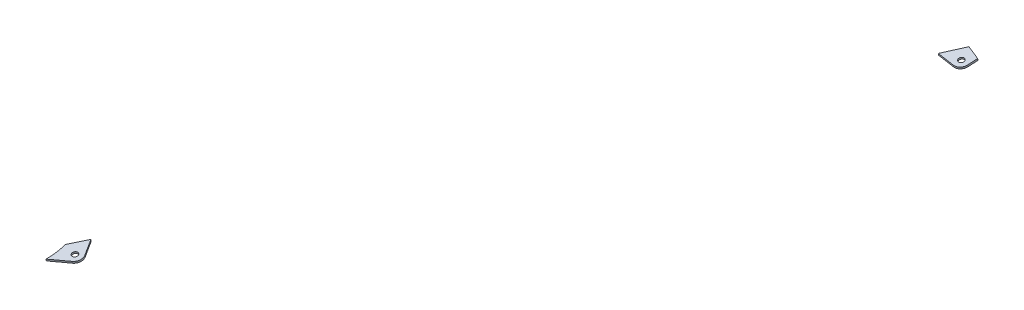
ISO-10303-21;
HEADER;
FILE_DESCRIPTION(('STEP AP214'),'2;1');
FILE_NAME('part.step','',(''),(''),'','','');
FILE_SCHEMA(('AUTOMOTIVE_DESIGN { 1 0 10303 214 1 1 1 1 }'));
ENDSEC;
DATA;
#1=APPLICATION_CONTEXT('core data for automotive mechanical design processes');
#2=APPLICATION_PROTOCOL_DEFINITION('international standard','automotive_design',2000,#1);
#3=PRODUCT_CONTEXT('',#1,'mechanical');
#4=PRODUCT('Part','Part','',(#3));
#5=PRODUCT_RELATED_PRODUCT_CATEGORY('part','',(#4));
#6=PRODUCT_DEFINITION_FORMATION('','',#4);
#7=PRODUCT_DEFINITION_CONTEXT('part definition',#1,'design');
#8=PRODUCT_DEFINITION('design','',#6,#7);
#9=PRODUCT_DEFINITION_SHAPE('','',#8);
#10=(LENGTH_UNIT() NAMED_UNIT(*) SI_UNIT(.MILLI.,.METRE.));
#11=(NAMED_UNIT(*) PLANE_ANGLE_UNIT() SI_UNIT($,.RADIAN.));
#12=(NAMED_UNIT(*) SI_UNIT($,.STERADIAN.) SOLID_ANGLE_UNIT());
#13=UNCERTAINTY_MEASURE_WITH_UNIT(LENGTH_MEASURE(1.E-05),#10,'distance_accuracy_value','');
#14=(GEOMETRIC_REPRESENTATION_CONTEXT(3) GLOBAL_UNCERTAINTY_ASSIGNED_CONTEXT((#13)) GLOBAL_UNIT_ASSIGNED_CONTEXT((#10,
#11,#12)) REPRESENTATION_CONTEXT('',''));
#15=CARTESIAN_POINT('',(0.,0.,0.));
#16=DIRECTION('',(0.,0.,1.));
#17=DIRECTION('',(1.,0.,0.));
#18=AXIS2_PLACEMENT_3D('',#15,#16,#17);
#19=CARTESIAN_POINT('',(1354.98932451011,276.212451039503,480.361696182311));
#20=DIRECTION('',(0.,-0.981627183447661,-0.190808995376562));
#21=DIRECTION('',(0.,0.190808995376562,-0.981627183447661));
#22=AXIS2_PLACEMENT_3D('',#19,#20,#21);
#23=PLANE('',#22);
#24=CARTESIAN_POINT('',(1354.98932451011,276.212451039503,480.361696182311));
#25=DIRECTION('',(0.,-0.981627183447661,-0.190808995376562));
#26=DIRECTION('',(0.,0.190808995376562,-0.981627183447661));
#27=AXIS2_PLACEMENT_3D('',#24,#25,#26);
#28=CIRCLE('',#27,7.99999999999986);
#29=CARTESIAN_POINT('',(1362.92379772878,276.017476852443,481.364751419359));
#30=VERTEX_POINT('',#29);
#31=CARTESIAN_POINT('',(1353.96749539416,274.698482175806,488.150390780096));
#32=VERTEX_POINT('',#31);
#33=EDGE_CURVE('E167',#30,#32,#28,.T.);
#34=ORIENTED_EDGE('',*,*,#33,.T.);
#35=DIRECTION('',(-0.991809152333897,0.0243717733825106,-0.125381904631039));
#36=VECTOR('',#35,1.);
#37=CARTESIAN_POINT('',(1353.96749539416,274.698482175806,488.150390780096));
#38=LINE('',#37,#36);
#39=CARTESIAN_POINT('',(1335.13531275181,275.161246293861,485.769675778116));
#40=VERTEX_POINT('',#39);
#41=EDGE_CURVE('E95',#32,#40,#38,.T.);
#42=ORIENTED_EDGE('',*,*,#41,.T.);
#43=CARTESIAN_POINT('',(1335.13531275181,275.161246293861,485.769675778116));
#44=CARTESIAN_POINT('',(1339.85772152624,276.415392376429,479.317653512426));
#45=CARTESIAN_POINT('',(1344.58198837943,277.670037192716,472.863065484177));
#46=CARTESIAN_POINT('',(1349.30810444123,278.92517838675,466.4059238138));
#47=(BOUNDED_CURVE() B_SPLINE_CURVE(3,(#43,#44,#45,#46),.UNSPECIFIED.,.F.,
.F.) B_SPLINE_CURVE_WITH_KNOTS((4,4),(0.966451554038019,1.),
.UNSPECIFIED.) CURVE() GEOMETRIC_REPRESENTATION_ITEM() RATIONAL_B_SPLINE_CURVE((0.999946517430463,
0.999963726106587,0.999981553629766,1.)) REPRESENTATION_ITEM(''));
#48=CARTESIAN_POINT('',(1349.30810444123,278.92517838675,466.4059238138));
#49=VERTEX_POINT('',#48);
#50=EDGE_CURVE('E99',#40,#49,#47,.T.);
#51=ORIENTED_EDGE('',*,*,#50,.T.);
#52=CARTESIAN_POINT('',(1349.30810444123,278.92517838675,466.4059238138));
#53=CARTESIAN_POINT('',(1354.32710970895,278.559702671224,468.286133373849));
#54=CARTESIAN_POINT('',(1359.30519225234,278.211483863424,470.077563839949));
#55=CARTESIAN_POINT('',(1364.18260300115,277.882555815343,471.769751950667));
#56=(BOUNDED_CURVE() B_SPLINE_CURVE(3,(#52,#53,#54,#55),.UNSPECIFIED.,.F.,
.F.) B_SPLINE_CURVE_WITH_KNOTS((4,4),(0.918491708652487,1.),
.UNSPECIFIED.) CURVE() GEOMETRIC_REPRESENTATION_ITEM() RATIONAL_B_SPLINE_CURVE((0.85094018893203,
0.896217531077208,0.945904134766531,1.)) REPRESENTATION_ITEM(''));
#57=CARTESIAN_POINT('',(1364.18260300115,277.882555815343,471.769751950667));
#58=VERTEX_POINT('',#57);
#59=EDGE_CURVE('E103',#49,#58,#56,.T.);
#60=ORIENTED_EDGE('',*,*,#59,.T.);
#61=DIRECTION('',(-0.127728639492945,-0.189246107962107,0.973586824723135));
#62=VECTOR('',#61,1.);
#63=CARTESIAN_POINT('',(1362.92379772878,276.017476852443,481.364751419359));
#64=LINE('',#63,#62);
#65=EDGE_CURVE('E61',#58,#30,#64,.T.);
#66=ORIENTED_EDGE('',*,*,#65,.T.);
#67=EDGE_LOOP('',(#34,#42,#51,#60,#66));
#68=FACE_BOUND('',#67,.T.);
#69=CARTESIAN_POINT('',(1354.98932451011,276.212451039503,480.361696182311));
#70=DIRECTION('',(0.,-0.981627183447661,-0.190808995376562));
#71=DIRECTION('',(0.,0.190808995376562,-0.981627183447661));
#72=AXIS2_PLACEMENT_3D('',#69,#70,#71);
#73=CIRCLE('',#72,2.99999999999991);
#74=CARTESIAN_POINT('',(1354.98932451011,276.784878025633,477.416814631968));
#75=VERTEX_POINT('',#74);
#76=EDGE_CURVE('E158',#75,#75,#73,.T.);
#77=ORIENTED_EDGE('',*,*,#76,.F.);
#78=EDGE_LOOP('',(#77));
#79=FACE_BOUND('',#78,.T.);
#80=ADVANCED_FACE('F44',(#68,#79),#23,.T.);
#81=CARTESIAN_POINT('',(1354.98932451011,278.175705406398,480.743314173064));
#82=DIRECTION('',(0.,-0.981627183447661,-0.190808995376562));
#83=DIRECTION('',(0.,0.190808995376562,-0.981627183447661));
#84=AXIS2_PLACEMENT_3D('',#81,#82,#83);
#85=PLANE('',#84);
#86=CARTESIAN_POINT('',(1354.98932451011,278.175705406398,480.743314173064));
#87=DIRECTION('',(0.,-0.981627183447661,-0.190808995376562));
#88=DIRECTION('',(0.,0.190808995376562,-0.981627183447661));
#89=AXIS2_PLACEMENT_3D('',#86,#87,#88);
#90=CIRCLE('',#89,7.99999999999986);
#91=CARTESIAN_POINT('',(1362.92379772878,277.980731219338,481.746369410112));
#92=VERTEX_POINT('',#91);
#93=CARTESIAN_POINT('',(1353.96749539416,276.661736542701,488.532008770849));
#94=VERTEX_POINT('',#93);
#95=EDGE_CURVE('E164',#92,#94,#90,.T.);
#96=ORIENTED_EDGE('',*,*,#95,.F.);
#97=DIRECTION('',(-0.127728639492945,-0.189246107962107,0.973586824723135));
#98=VECTOR('',#97,1.);
#99=CARTESIAN_POINT('',(1362.92379772878,277.980731219338,481.746369410112));
#100=LINE('',#99,#98);
#101=CARTESIAN_POINT('',(1364.18260300115,279.845810182239,472.15136994142));
#102=VERTEX_POINT('',#101);
#103=EDGE_CURVE('E87',#102,#92,#100,.T.);
#104=ORIENTED_EDGE('',*,*,#103,.F.);
#105=CARTESIAN_POINT('',(1349.30810444123,280.888432753645,466.787541804553));
#106=CARTESIAN_POINT('',(1354.32710970895,280.522957038119,468.667751364602));
#107=CARTESIAN_POINT('',(1359.30519225234,280.17473823032,470.459181830702));
#108=CARTESIAN_POINT('',(1364.18260300115,279.845810182239,472.15136994142));
#109=(BOUNDED_CURVE() B_SPLINE_CURVE(3,(#105,#106,#107,#108),.UNSPECIFIED.,.F.,
.F.) B_SPLINE_CURVE_WITH_KNOTS((4,4),(0.918491708652487,1.),
.UNSPECIFIED.) CURVE() GEOMETRIC_REPRESENTATION_ITEM() RATIONAL_B_SPLINE_CURVE((0.85094018893203,
0.896217531077208,0.945904134766531,1.)) REPRESENTATION_ITEM(''));
#110=CARTESIAN_POINT('',(1349.30810444123,280.888432753645,466.787541804553));
#111=VERTEX_POINT('',#110);
#112=EDGE_CURVE('E81',#111,#102,#109,.T.);
#113=ORIENTED_EDGE('',*,*,#112,.F.);
#114=CARTESIAN_POINT('',(1335.13531275181,277.124500660756,486.151293768869));
#115=CARTESIAN_POINT('',(1339.85772152624,278.378646743324,479.699271503179));
#116=CARTESIAN_POINT('',(1344.58198837943,279.633291559612,473.24468347493));
#117=CARTESIAN_POINT('',(1349.30810444123,280.888432753645,466.787541804553));
#118=(BOUNDED_CURVE() B_SPLINE_CURVE(3,(#114,#115,#116,#117),.UNSPECIFIED.,.F.,
.F.) B_SPLINE_CURVE_WITH_KNOTS((4,4),(0.966451554038019,1.),
.UNSPECIFIED.) CURVE() GEOMETRIC_REPRESENTATION_ITEM() RATIONAL_B_SPLINE_CURVE((0.999946517430463,
0.999963726106587,0.999981553629766,1.)) REPRESENTATION_ITEM(''));
#119=CARTESIAN_POINT('',(1335.13531275181,277.124500660756,486.151293768869));
#120=VERTEX_POINT('',#119);
#121=EDGE_CURVE('E110',#120,#111,#118,.T.);
#122=ORIENTED_EDGE('',*,*,#121,.F.);
#123=DIRECTION('',(-0.991809152333897,0.0243717733825106,-0.125381904631039));
#124=VECTOR('',#123,1.);
#125=CARTESIAN_POINT('',(1353.96749539416,276.661736542701,488.532008770849));
#126=LINE('',#125,#124);
#127=EDGE_CURVE('E178',#94,#120,#126,.T.);
#128=ORIENTED_EDGE('',*,*,#127,.F.);
#129=EDGE_LOOP('',(#96,#104,#113,#122,#128));
#130=FACE_BOUND('',#129,.T.);
#131=CARTESIAN_POINT('',(1354.98932451011,278.175705406398,480.743314173064));
#132=DIRECTION('',(0.,-0.981627183447661,-0.190808995376562));
#133=DIRECTION('',(0.,0.190808995376562,-0.981627183447661));
#134=AXIS2_PLACEMENT_3D('',#131,#132,#133);
#135=CIRCLE('',#134,2.99999999999991);
#136=CARTESIAN_POINT('',(1354.98932451011,278.748132392528,477.798432622721));
#137=VERTEX_POINT('',#136);
#138=EDGE_CURVE('E161',#137,#137,#135,.T.);
#139=ORIENTED_EDGE('',*,*,#138,.T.);
#140=EDGE_LOOP('',(#139));
#141=FACE_BOUND('',#140,.T.);
#142=ADVANCED_FACE('F140',(#130,#141),#85,.F.);
#143=CARTESIAN_POINT('',(1354.98932451011,276.212451039503,480.361696182311));
#144=DIRECTION('',(0.,0.981627183447661,0.190808995376562));
#145=DIRECTION('',(0.,-0.190808995376562,0.981627183447661));
#146=AXIS2_PLACEMENT_3D('',#143,#144,#145);
#147=CYLINDRICAL_SURFACE('',#146,7.99999999999986);
#148=ORIENTED_EDGE('',*,*,#95,.T.);
#149=DIRECTION('',(0.,0.981627183447661,0.190808995376562));
#150=VECTOR('',#149,1.);
#151=CARTESIAN_POINT('',(1353.96749539416,274.698482175806,488.150390780096));
#152=LINE('',#151,#150);
#153=EDGE_CURVE('E12',#32,#94,#152,.T.);
#154=ORIENTED_EDGE('',*,*,#153,.F.);
#155=ORIENTED_EDGE('',*,*,#33,.F.);
#156=DIRECTION('',(0.,0.981627183447661,0.190808995376562));
#157=VECTOR('',#156,1.);
#158=CARTESIAN_POINT('',(1362.92379772878,276.017476852443,481.364751419359));
#159=LINE('',#158,#157);
#160=EDGE_CURVE('E115',#30,#92,#159,.T.);
#161=ORIENTED_EDGE('',*,*,#160,.T.);
#162=EDGE_LOOP('',(#148,#154,#155,#161));
#163=FACE_BOUND('',#162,.T.);
#164=ADVANCED_FACE('F46',(#163),#147,.T.);
#165=CARTESIAN_POINT('',(1353.96749539416,274.698482175806,488.150390780096));
#166=DIRECTION('',(0.127728639492932,0.189246107962104,-0.973586824723137));
#167=DIRECTION('',(0.,0.981627183447662,0.190808995376555));
#168=AXIS2_PLACEMENT_3D('',#165,#166,#167);
#169=PLANE('',#168);
#170=ORIENTED_EDGE('',*,*,#127,.T.);
#171=DIRECTION('',(0.,0.981627183447661,0.190808995376562));
#172=VECTOR('',#171,1.);
#173=CARTESIAN_POINT('',(1335.13531275181,275.161246293861,485.769675778116));
#174=LINE('',#173,#172);
#175=EDGE_CURVE('E53',#40,#120,#174,.T.);
#176=ORIENTED_EDGE('',*,*,#175,.F.);
#177=ORIENTED_EDGE('',*,*,#41,.F.);
#178=ORIENTED_EDGE('',*,*,#153,.T.);
#179=EDGE_LOOP('',(#170,#176,#177,#178));
#180=FACE_BOUND('',#179,.T.);
#181=ADVANCED_FACE('F135',(#180),#169,.F.);
#182=DIRECTION('',(0.,0.981627183447661,0.190808995376562));
#183=VECTOR('',#182,1.);
#184=SURFACE_OF_LINEAR_EXTRUSION('',#47,#183);
#185=ORIENTED_EDGE('',*,*,#121,.T.);
#186=DIRECTION('',(0.,0.981627183447661,0.190808995376562));
#187=VECTOR('',#186,1.);
#188=CARTESIAN_POINT('',(1349.30810444123,278.92517838675,466.4059238138));
#189=LINE('',#188,#187);
#190=EDGE_CURVE('E107',#49,#111,#189,.T.);
#191=ORIENTED_EDGE('',*,*,#190,.F.);
#192=ORIENTED_EDGE('',*,*,#50,.F.);
#193=ORIENTED_EDGE('',*,*,#175,.T.);
#194=EDGE_LOOP('',(#185,#191,#192,#193));
#195=FACE_BOUND('',#194,.T.);
#196=ADVANCED_FACE('F108',(#195),#184,.F.);
#197=DIRECTION('',(0.,0.981627183447661,0.190808995376562));
#198=VECTOR('',#197,1.);
#199=SURFACE_OF_LINEAR_EXTRUSION('',#56,#198);
#200=ORIENTED_EDGE('',*,*,#112,.T.);
#201=DIRECTION('',(0.,0.981627183447661,0.190808995376562));
#202=VECTOR('',#201,1.);
#203=CARTESIAN_POINT('',(1364.18260300115,277.882555815343,471.769751950667));
#204=LINE('',#203,#202);
#205=EDGE_CURVE('E111',#58,#102,#204,.T.);
#206=ORIENTED_EDGE('',*,*,#205,.F.);
#207=ORIENTED_EDGE('',*,*,#59,.F.);
#208=ORIENTED_EDGE('',*,*,#190,.T.);
#209=EDGE_LOOP('',(#200,#206,#207,#208));
#210=FACE_BOUND('',#209,.T.);
#211=ADVANCED_FACE('F113',(#210),#199,.F.);
#212=CARTESIAN_POINT('',(1362.92379772878,276.017476852443,481.364751419359));
#213=DIRECTION('',(-0.991809152333896,0.024371773382512,-0.125381904631052));
#214=DIRECTION('',(-0.125419158609162,0.,0.992103842676647));
#215=AXIS2_PLACEMENT_3D('',#212,#213,#214);
#216=PLANE('',#215);
#217=ORIENTED_EDGE('',*,*,#103,.T.);
#218=ORIENTED_EDGE('',*,*,#160,.F.);
#219=ORIENTED_EDGE('',*,*,#65,.F.);
#220=ORIENTED_EDGE('',*,*,#205,.T.);
#221=EDGE_LOOP('',(#217,#218,#219,#220));
#222=FACE_BOUND('',#221,.T.);
#223=ADVANCED_FACE('F132',(#222),#216,.F.);
#224=CARTESIAN_POINT('',(1354.98932451011,276.212451039503,480.361696182311));
#225=DIRECTION('',(0.,0.981627183447661,0.190808995376562));
#226=DIRECTION('',(0.,-0.190808995376562,0.981627183447661));
#227=AXIS2_PLACEMENT_3D('',#224,#225,#226);
#228=CYLINDRICAL_SURFACE('',#227,2.99999999999991);
#229=ORIENTED_EDGE('',*,*,#76,.T.);
#230=EDGE_LOOP('',(#229));
#231=FACE_BOUND('',#230,.T.);
#232=ORIENTED_EDGE('',*,*,#138,.F.);
#233=EDGE_LOOP('',(#232));
#234=FACE_BOUND('',#233,.T.);
#235=ADVANCED_FACE('F149',(#231,#234),#228,.F.);
#236=CLOSED_SHELL('',(#80,#142,#164,#181,#196,#211,#223,#235));
#237=MANIFOLD_SOLID_BREP('B2',#236);
#238=CARTESIAN_POINT('',(932.480143644817,166.144613374247,1046.61163247233));
#239=DIRECTION('',(1.32856421615641E-11,-0.981627183448244,-0.190808995373559));
#240=DIRECTION('',(0.,0.190808995373559,-0.981627183448244));
#241=AXIS2_PLACEMENT_3D('',#238,#239,#240);
#242=PLANE('',#241);
#243=CARTESIAN_POINT('',(932.070864738082,168.131195258437,1036.39155466197));
#244=CARTESIAN_POINT('',(932.179682868194,167.903790071605,1037.56145292913));
#245=CARTESIAN_POINT('',(932.271293946924,167.676283122056,1038.7318747201));
#246=CARTESIAN_POINT('',(932.467876959003,167.040938195084,1042.00044101568));
#247=CARTESIAN_POINT('',(932.526546787791,166.632826386435,1044.09999425983));
#248=CARTESIAN_POINT('',(932.450892162383,165.815461398526,1048.30497259089));
#249=CARTESIAN_POINT('',(932.317793571358,165.406215469037,1050.41036038096));
#250=CARTESIAN_POINT('',(931.904919364846,164.791085551674,1053.57492946767));
#251=CARTESIAN_POINT('',(931.730758064932,164.585601225413,1054.63205468356));
#252=CARTESIAN_POINT('',(931.433937078824,164.307083304953,1056.06490516978));
#253=CARTESIAN_POINT('',(931.346908094581,164.23129641706,1056.45479490825));
#254=CARTESIAN_POINT('',(931.253435448425,164.155870494633,1056.84282764038));
#255=B_SPLINE_CURVE_WITH_KNOTS('',3,(#243,#244,#245,#246,#247,#248,#249,#250,#251,#252,#253,
#254),.UNSPECIFIED.,.F.,.F.,(4,2,2,2,2,4),(0.0389952168181723,0.108784614257796,
0.233784614257793,0.35878461425779,0.421284614257795,0.444789397439628),.UNSPECIFIED.);
#256=CARTESIAN_POINT('',(931.253435448425,164.155870494633,1056.84282764038));
#257=VERTEX_POINT('',#256);
#258=CARTESIAN_POINT('',(932.070864738085,168.131195258429,1036.39155466201));
#259=VERTEX_POINT('',#258);
#260=EDGE_CURVE('E324',#257,#259,#255,.F.);
#261=ORIENTED_EDGE('',*,*,#260,.T.);
#262=CARTESIAN_POINT('',(932.070864738085,168.131195258429,1036.39155466201));
#263=CARTESIAN_POINT('',(936.101696367413,169.143684342061,1031.18274988068));
#264=CARTESIAN_POINT('',(940.13433811071,170.156631841329,1025.97158675535));
#265=CARTESIAN_POINT('',(944.168784694913,171.17003643188,1020.75807209923));
#266=(BOUNDED_CURVE() B_SPLINE_CURVE(3,(#262,#263,#264,#265),.UNSPECIFIED.,.F.,
.F.) B_SPLINE_CURVE_WITH_KNOTS((4,4),(0.,0.0283733380516184),
.UNSPECIFIED.) CURVE() GEOMETRIC_REPRESENTATION_ITEM() RATIONAL_B_SPLINE_CURVE((1.,
0.9999843991254,0.999969240899689,0.999954525322867)) REPRESENTATION_ITEM(''));
#267=CARTESIAN_POINT('',(944.168784694913,171.17003643188,1020.75807209923));
#268=VERTEX_POINT('',#267);
#269=EDGE_CURVE('E293',#259,#268,#266,.T.);
#270=ORIENTED_EDGE('',*,*,#269,.T.);
#271=DIRECTION('',(0.48900119651544,-0.166439464539092,0.856256815710338));
#272=VECTOR('',#271,1.);
#273=CARTESIAN_POINT('',(952.848375326929,168.21579740853,1035.95631433094));
#274=LINE('',#273,#272);
#275=CARTESIAN_POINT('',(952.848375326929,168.21579740853,1035.95631433094));
#276=VERTEX_POINT('',#275);
#277=EDGE_CURVE('E297',#268,#276,#274,.T.);
#278=ORIENTED_EDGE('',*,*,#277,.T.);
#279=CARTESIAN_POINT('',(945.870110420262,167.46935079217,1039.79644926885));
#280=DIRECTION('',(0.,-0.981627183447661,-0.190808995376562));
#281=DIRECTION('',(0.,0.190808995376562,-0.981627183447661));
#282=AXIS2_PLACEMENT_3D('',#279,#280,#281);
#283=CIRCLE('',#282,7.9999999999998);
#284=CARTESIAN_POINT('',(949.782119992386,166.137835075857,1046.64650379453));
#285=VERTEX_POINT('',#284);
#286=EDGE_CURVE('E301',#276,#285,#283,.T.);
#287=ORIENTED_EDGE('',*,*,#286,.T.);
#288=DIRECTION('',(-0.872283113333745,-0.0933058270448596,0.48001686723725));
#289=VECTOR('',#288,1.);
#290=CARTESIAN_POINT('',(949.782119992386,166.137835075857,1046.64650379453));
#291=LINE('',#290,#289);
#292=EDGE_CURVE('E259',#285,#257,#291,.T.);
#293=ORIENTED_EDGE('',*,*,#292,.T.);
#294=EDGE_LOOP('',(#261,#270,#278,#287,#293));
#295=FACE_BOUND('',#294,.T.);
#296=CARTESIAN_POINT('',(945.870110420262,167.46935079217,1039.79644926885));
#297=DIRECTION('',(0.,-0.981627183447661,-0.190808995376562));
#298=DIRECTION('',(0.,0.190808995376562,-0.981627183447661));
#299=AXIS2_PLACEMENT_3D('',#296,#297,#298);
#300=CIRCLE('',#299,2.99999999999994);
#301=CARTESIAN_POINT('',(945.870110420262,168.041777778299,1036.8515677185));
#302=VERTEX_POINT('',#301);
#303=EDGE_CURVE('E364',#302,#302,#300,.T.);
#304=ORIENTED_EDGE('',*,*,#303,.F.);
#305=EDGE_LOOP('',(#304));
#306=FACE_BOUND('',#305,.T.);
#307=ADVANCED_FACE('F236',(#295,#306),#242,.T.);
#308=CARTESIAN_POINT('',(932.480143644817,168.107867741142,1046.99325046308));
#309=DIRECTION('',(1.32856421615641E-11,-0.981627183448244,-0.190808995373559));
#310=DIRECTION('',(0.,0.190808995373559,-0.981627183448244));
#311=AXIS2_PLACEMENT_3D('',#308,#309,#310);
#312=PLANE('',#311);
#313=CARTESIAN_POINT('',(931.253435448425,166.119124861528,1057.22444563113));
#314=CARTESIAN_POINT('',(931.346908094581,166.194550783955,1056.836412899));
#315=CARTESIAN_POINT('',(931.433937078824,166.270337671848,1056.44652316053));
#316=CARTESIAN_POINT('',(931.730758064932,166.548855592308,1055.01367267431));
#317=CARTESIAN_POINT('',(931.904919364846,166.75433991857,1053.95654745843));
#318=CARTESIAN_POINT('',(932.317793571358,167.369469835933,1050.79197837171));
#319=CARTESIAN_POINT('',(932.450892162383,167.778715765422,1048.68659058164));
#320=CARTESIAN_POINT('',(932.526546787791,168.59608075333,1044.48161225058));
#321=CARTESIAN_POINT('',(932.467876959003,169.004192561979,1042.38205900643));
#322=CARTESIAN_POINT('',(932.271293946924,169.639537488951,1039.11349271085));
#323=CARTESIAN_POINT('',(932.179682868194,169.867044438501,1037.94307091989));
#324=CARTESIAN_POINT('',(932.070864738082,170.094449625332,1036.77317265272));
#325=B_SPLINE_CURVE_WITH_KNOTS('',3,(#313,#314,#315,#316,#317,#318,#319,#320,#321,#322,#323,
#324),.UNSPECIFIED.,.F.,.F.,(4,2,2,2,2,4),(0.0389952168181723,0.0625000000000052,
0.12500000000001,0.250000000000007,0.375000000000004,0.444789397439628),.UNSPECIFIED.);
#326=CARTESIAN_POINT('',(931.253435448425,166.119124861528,1057.22444563113));
#327=VERTEX_POINT('',#326);
#328=CARTESIAN_POINT('',(932.070864738086,170.094449625324,1036.77317265276));
#329=VERTEX_POINT('',#328);
#330=EDGE_CURVE('E362',#327,#329,#325,.T.);
#331=ORIENTED_EDGE('',*,*,#330,.F.);
#332=DIRECTION('',(-0.872283113333745,-0.0933058270448596,0.48001686723725));
#333=VECTOR('',#332,1.);
#334=CARTESIAN_POINT('',(949.782119992386,168.101089442752,1047.02812178528));
#335=LINE('',#334,#333);
#336=CARTESIAN_POINT('',(949.782119992386,168.101089442752,1047.02812178528));
#337=VERTEX_POINT('',#336);
#338=EDGE_CURVE('E285',#337,#327,#335,.T.);
#339=ORIENTED_EDGE('',*,*,#338,.F.);
#340=CARTESIAN_POINT('',(945.870110420263,169.432605159065,1040.1780672596));
#341=DIRECTION('',(0.,-0.981627183447661,-0.190808995376562));
#342=DIRECTION('',(0.,0.190808995376562,-0.981627183447661));
#343=AXIS2_PLACEMENT_3D('',#340,#341,#342);
#344=CIRCLE('',#343,7.9999999999998);
#345=CARTESIAN_POINT('',(952.848375326929,170.179051775425,1036.3379323217));
#346=VERTEX_POINT('',#345);
#347=EDGE_CURVE('E279',#346,#337,#344,.T.);
#348=ORIENTED_EDGE('',*,*,#347,.F.);
#349=DIRECTION('',(0.48900119651544,-0.166439464539092,0.856256815710338));
#350=VECTOR('',#349,1.);
#351=CARTESIAN_POINT('',(952.848375326929,170.179051775425,1036.3379323217));
#352=LINE('',#351,#350);
#353=CARTESIAN_POINT('',(944.168784694914,173.133290798776,1021.13969008998));
#354=VERTEX_POINT('',#353);
#355=EDGE_CURVE('E308',#354,#346,#352,.T.);
#356=ORIENTED_EDGE('',*,*,#355,.F.);
#357=CARTESIAN_POINT('',(932.070864738086,170.094449625324,1036.77317265276));
#358=CARTESIAN_POINT('',(936.101696367413,171.106938708956,1031.56436787144));
#359=CARTESIAN_POINT('',(940.13433811071,172.119886208224,1026.35320474611));
#360=CARTESIAN_POINT('',(944.168784694914,173.133290798776,1021.13969008998));
#361=(BOUNDED_CURVE() B_SPLINE_CURVE(3,(#357,#358,#359,#360),.UNSPECIFIED.,.F.,
.F.) B_SPLINE_CURVE_WITH_KNOTS((4,4),(0.,0.0283733380516184),
.UNSPECIFIED.) CURVE() GEOMETRIC_REPRESENTATION_ITEM() RATIONAL_B_SPLINE_CURVE((1.,
0.9999843991254,0.999969240899689,0.999954525322867)) REPRESENTATION_ITEM(''));
#362=EDGE_CURVE('E318',#329,#354,#361,.T.);
#363=ORIENTED_EDGE('',*,*,#362,.F.);
#364=EDGE_LOOP('',(#331,#339,#348,#356,#363));
#365=FACE_BOUND('',#364,.T.);
#366=CARTESIAN_POINT('',(945.870110420263,169.432605159065,1040.1780672596));
#367=DIRECTION('',(0.,-0.981627183447661,-0.190808995376562));
#368=DIRECTION('',(0.,0.190808995376562,-0.981627183447661));
#369=AXIS2_PLACEMENT_3D('',#366,#367,#368);
#370=CIRCLE('',#369,2.99999999999994);
#371=CARTESIAN_POINT('',(945.870110420263,170.005032145195,1037.23318570926));
#372=VERTEX_POINT('',#371);
#373=EDGE_CURVE('E368',#372,#372,#370,.T.);
#374=ORIENTED_EDGE('',*,*,#373,.T.);
#375=EDGE_LOOP('',(#374));
#376=FACE_BOUND('',#375,.T.);
#377=ADVANCED_FACE('F340',(#365,#376),#312,.F.);
#378=CARTESIAN_POINT('',(931.253435448425,164.155870494633,1056.84282764038));
#379=CARTESIAN_POINT('',(931.346908094581,164.23129641706,1056.45479490825));
#380=CARTESIAN_POINT('',(931.433937078824,164.307083304953,1056.06490516978));
#381=CARTESIAN_POINT('',(931.730758064932,164.585601225413,1054.63205468356));
#382=CARTESIAN_POINT('',(931.904919364846,164.791085551674,1053.57492946767));
#383=CARTESIAN_POINT('',(932.317793571358,165.406215469037,1050.41036038096));
#384=CARTESIAN_POINT('',(932.450892162383,165.815461398526,1048.30497259089));
#385=CARTESIAN_POINT('',(932.526546787791,166.632826386435,1044.09999425983));
#386=CARTESIAN_POINT('',(932.467876959003,167.040938195084,1042.00044101568));
#387=CARTESIAN_POINT('',(932.271293946924,167.676283122056,1038.7318747201));
#388=CARTESIAN_POINT('',(932.179682868194,167.903790071605,1037.56145292913));
#389=CARTESIAN_POINT('',(932.070864738082,168.131195258437,1036.39155466197));
#390=B_SPLINE_CURVE_WITH_KNOTS('',3,(#378,#379,#380,#381,#382,#383,#384,#385,#386,#387,#388,
#389),.UNSPECIFIED.,.F.,.F.,(4,2,2,2,2,4),(0.0389952168181723,0.0625000000000052,
0.12500000000001,0.250000000000007,0.375000000000004,0.444789397439628),.UNSPECIFIED.);
#391=DIRECTION('',(0.,0.981627183447661,0.190808995376562));
#392=VECTOR('',#391,1.);
#393=SURFACE_OF_LINEAR_EXTRUSION('',#390,#392);
#394=ORIENTED_EDGE('',*,*,#330,.T.);
#395=DIRECTION('',(0.,0.981627183447661,0.190808995376562));
#396=VECTOR('',#395,1.);
#397=CARTESIAN_POINT('',(932.070864738085,168.131195258429,1036.39155466201));
#398=LINE('',#397,#396);
#399=EDGE_CURVE('E42',#259,#329,#398,.T.);
#400=ORIENTED_EDGE('',*,*,#399,.F.);
#401=ORIENTED_EDGE('',*,*,#260,.F.);
#402=DIRECTION('',(0.,0.981627183447661,0.190808995376562));
#403=VECTOR('',#402,1.);
#404=CARTESIAN_POINT('',(931.253435448425,164.155870494633,1056.84282764038));
#405=LINE('',#404,#403);
#406=EDGE_CURVE('E313',#257,#327,#405,.T.);
#407=ORIENTED_EDGE('',*,*,#406,.T.);
#408=EDGE_LOOP('',(#394,#400,#401,#407));
#409=FACE_BOUND('',#408,.T.);
#410=ADVANCED_FACE('F238',(#409),#393,.F.);
#411=DIRECTION('',(0.,0.981627183447661,0.190808995376562));
#412=VECTOR('',#411,1.);
#413=SURFACE_OF_LINEAR_EXTRUSION('',#266,#412);
#414=ORIENTED_EDGE('',*,*,#362,.T.);
#415=DIRECTION('',(0.,0.981627183447661,0.190808995376562));
#416=VECTOR('',#415,1.);
#417=CARTESIAN_POINT('',(944.168784694913,171.17003643188,1020.75807209923));
#418=LINE('',#417,#416);
#419=EDGE_CURVE('E250',#268,#354,#418,.T.);
#420=ORIENTED_EDGE('',*,*,#419,.F.);
#421=ORIENTED_EDGE('',*,*,#269,.F.);
#422=ORIENTED_EDGE('',*,*,#399,.T.);
#423=EDGE_LOOP('',(#414,#420,#421,#422));
#424=FACE_BOUND('',#423,.T.);
#425=ADVANCED_FACE('F387',(#424),#413,.F.);
#426=CARTESIAN_POINT('',(952.848375326929,168.21579740853,1035.95631433094));
#427=DIRECTION('',(-0.872283113333319,-0.0933058270450053,0.480016867237996));
#428=DIRECTION('',(0.482120118377001,0.,0.876105125801776));
#429=AXIS2_PLACEMENT_3D('',#426,#427,#428);
#430=PLANE('',#429);
#431=ORIENTED_EDGE('',*,*,#355,.T.);
#432=DIRECTION('',(0.,0.981627183447661,0.190808995376562));
#433=VECTOR('',#432,1.);
#434=CARTESIAN_POINT('',(952.848375326929,168.21579740853,1035.95631433094));
#435=LINE('',#434,#433);
#436=EDGE_CURVE('E305',#276,#346,#435,.T.);
#437=ORIENTED_EDGE('',*,*,#436,.F.);
#438=ORIENTED_EDGE('',*,*,#277,.F.);
#439=ORIENTED_EDGE('',*,*,#419,.T.);
#440=EDGE_LOOP('',(#431,#437,#438,#439));
#441=FACE_BOUND('',#440,.T.);
#442=ADVANCED_FACE('F306',(#441),#430,.F.);
#443=CARTESIAN_POINT('',(945.870110420262,167.46935079217,1039.79644926885));
#444=DIRECTION('',(0.,0.981627183447661,0.190808995376562));
#445=DIRECTION('',(0.,-0.190808995376562,0.981627183447661));
#446=AXIS2_PLACEMENT_3D('',#443,#444,#445);
#447=CYLINDRICAL_SURFACE('',#446,7.9999999999998);
#448=ORIENTED_EDGE('',*,*,#347,.T.);
#449=DIRECTION('',(0.,0.981627183447661,0.190808995376562));
#450=VECTOR('',#449,1.);
#451=CARTESIAN_POINT('',(949.782119992386,166.137835075857,1046.64650379453));
#452=LINE('',#451,#450);
#453=EDGE_CURVE('E309',#285,#337,#452,.T.);
#454=ORIENTED_EDGE('',*,*,#453,.F.);
#455=ORIENTED_EDGE('',*,*,#286,.F.);
#456=ORIENTED_EDGE('',*,*,#436,.T.);
#457=EDGE_LOOP('',(#448,#454,#455,#456));
#458=FACE_BOUND('',#457,.T.);
#459=ADVANCED_FACE('F311',(#458),#447,.T.);
#460=CARTESIAN_POINT('',(949.782119992386,166.137835075857,1046.64650379453));
#461=DIRECTION('',(-0.48900119651468,0.166439464539175,-0.856256815710756));
#462=DIRECTION('',(-0.868369110783912,0.,0.495918428208066));
#463=AXIS2_PLACEMENT_3D('',#460,#461,#462);
#464=PLANE('',#463);
#465=ORIENTED_EDGE('',*,*,#338,.T.);
#466=ORIENTED_EDGE('',*,*,#406,.F.);
#467=ORIENTED_EDGE('',*,*,#292,.F.);
#468=ORIENTED_EDGE('',*,*,#453,.T.);
#469=EDGE_LOOP('',(#465,#466,#467,#468));
#470=FACE_BOUND('',#469,.T.);
#471=ADVANCED_FACE('F346',(#470),#464,.F.);
#472=CARTESIAN_POINT('',(945.870110420262,167.46935079217,1039.79644926885));
#473=DIRECTION('',(0.,0.981627183447661,0.190808995376562));
#474=DIRECTION('',(0.,-0.190808995376562,0.981627183447661));
#475=AXIS2_PLACEMENT_3D('',#472,#473,#474);
#476=CYLINDRICAL_SURFACE('',#475,2.99999999999994);
#477=ORIENTED_EDGE('',*,*,#303,.T.);
#478=EDGE_LOOP('',(#477));
#479=FACE_BOUND('',#478,.T.);
#480=ORIENTED_EDGE('',*,*,#373,.F.);
#481=EDGE_LOOP('',(#480));
#482=FACE_BOUND('',#481,.T.);
#483=ADVANCED_FACE('F341',(#479,#482),#476,.F.);
#484=CLOSED_SHELL('',(#307,#377,#410,#425,#442,#459,#471,#483));
#485=MANIFOLD_SOLID_BREP('B6',#484);
#486=ADVANCED_BREP_SHAPE_REPRESENTATION('',(#18,#237,#485),#14);
#487=SHAPE_DEFINITION_REPRESENTATION(#9,#486);
ENDSEC;
END-ISO-10303-21;
